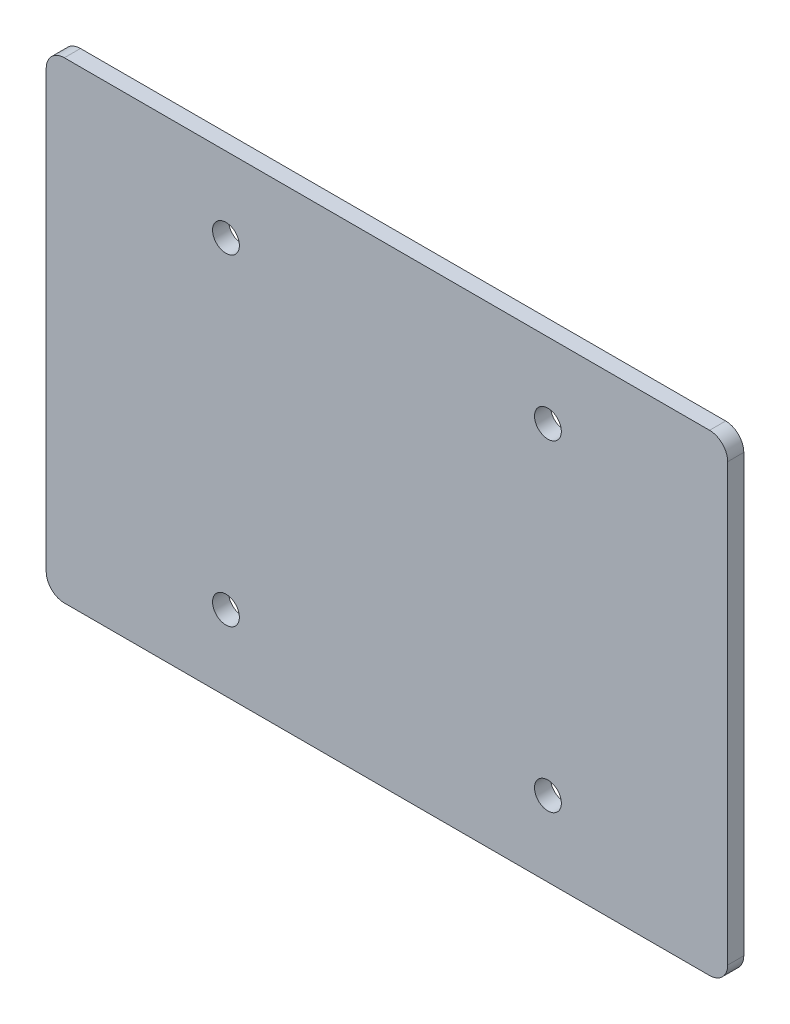
ISO-10303-21;
HEADER;
FILE_DESCRIPTION(('STEP AP214'),'2;1');
FILE_NAME('part.step','',(''),(''),'','','');
FILE_SCHEMA(('AUTOMOTIVE_DESIGN { 1 0 10303 214 1 1 1 1 }'));
ENDSEC;
DATA;
#1=APPLICATION_CONTEXT('core data for automotive mechanical design processes');
#2=APPLICATION_PROTOCOL_DEFINITION('international standard','automotive_design',2000,#1);
#3=PRODUCT_CONTEXT('',#1,'mechanical');
#4=PRODUCT('Part','Part','',(#3));
#5=PRODUCT_RELATED_PRODUCT_CATEGORY('part','',(#4));
#6=PRODUCT_DEFINITION_FORMATION('','',#4);
#7=PRODUCT_DEFINITION_CONTEXT('part definition',#1,'design');
#8=PRODUCT_DEFINITION('design','',#6,#7);
#9=PRODUCT_DEFINITION_SHAPE('','',#8);
#10=(LENGTH_UNIT() NAMED_UNIT(*) SI_UNIT(.MILLI.,.METRE.));
#11=(NAMED_UNIT(*) PLANE_ANGLE_UNIT() SI_UNIT($,.RADIAN.));
#12=(NAMED_UNIT(*) SI_UNIT($,.STERADIAN.) SOLID_ANGLE_UNIT());
#13=UNCERTAINTY_MEASURE_WITH_UNIT(LENGTH_MEASURE(1.E-05),#10,'distance_accuracy_value','');
#14=(GEOMETRIC_REPRESENTATION_CONTEXT(3) GLOBAL_UNCERTAINTY_ASSIGNED_CONTEXT((#13)) GLOBAL_UNIT_ASSIGNED_CONTEXT((#10,
#11,#12)) REPRESENTATION_CONTEXT('',''));
#15=CARTESIAN_POINT('',(0.,0.,0.));
#16=DIRECTION('',(0.,0.,1.));
#17=DIRECTION('',(1.,0.,0.));
#18=AXIS2_PLACEMENT_3D('',#15,#16,#17);
#19=CARTESIAN_POINT('',(63.5,-44.,3.));
#20=DIRECTION('',(-1.,0.,0.));
#21=DIRECTION('',(0.,0.,1.));
#22=AXIS2_PLACEMENT_3D('',#19,#20,#21);
#23=PLANE('',#22);
#24=DIRECTION('',(0.,1.,0.));
#25=VECTOR('',#24,1.);
#26=CARTESIAN_POINT('',(63.5,-44.,3.));
#27=LINE('',#26,#25);
#28=CARTESIAN_POINT('',(63.5,-40.62,3.));
#29=VERTEX_POINT('',#28);
#30=CARTESIAN_POINT('',(63.5,40.62,3.));
#31=VERTEX_POINT('',#30);
#32=EDGE_CURVE('E125',#29,#31,#27,.T.);
#33=ORIENTED_EDGE('',*,*,#32,.F.);
#34=DIRECTION('',(0.,0.,-1.));
#35=VECTOR('',#34,1.);
#36=CARTESIAN_POINT('',(63.5,-40.62,3.));
#37=LINE('',#36,#35);
#38=CARTESIAN_POINT('',(63.5,-40.62,0.));
#39=VERTEX_POINT('',#38);
#40=EDGE_CURVE('E151',#29,#39,#37,.T.);
#41=ORIENTED_EDGE('',*,*,#40,.T.);
#42=DIRECTION('',(0.,1.,0.));
#43=VECTOR('',#42,1.);
#44=CARTESIAN_POINT('',(63.5,-44.,0.));
#45=LINE('',#44,#43);
#46=CARTESIAN_POINT('',(63.5,40.62,0.));
#47=VERTEX_POINT('',#46);
#48=EDGE_CURVE('E157',#39,#47,#45,.T.);
#49=ORIENTED_EDGE('',*,*,#48,.T.);
#50=DIRECTION('',(0.,0.,-1.));
#51=VECTOR('',#50,1.);
#52=CARTESIAN_POINT('',(63.5,40.62,3.));
#53=LINE('',#52,#51);
#54=EDGE_CURVE('E149',#47,#31,#53,.F.);
#55=ORIENTED_EDGE('',*,*,#54,.T.);
#56=EDGE_LOOP('',(#33,#41,#49,#55));
#57=FACE_BOUND('',#56,.T.);
#58=ADVANCED_FACE('F33',(#57),#23,.F.);
#59=CARTESIAN_POINT('',(-63.5,44.,3.));
#60=DIRECTION('',(0.,-1.,0.));
#61=DIRECTION('',(0.,0.,-1.));
#62=AXIS2_PLACEMENT_3D('',#59,#60,#61);
#63=PLANE('',#62);
#64=DIRECTION('',(-1.,0.,0.));
#65=VECTOR('',#64,1.);
#66=CARTESIAN_POINT('',(-63.5,44.,3.));
#67=LINE('',#66,#65);
#68=CARTESIAN_POINT('',(60.12,44.,3.));
#69=VERTEX_POINT('',#68);
#70=CARTESIAN_POINT('',(-60.12,44.,3.));
#71=VERTEX_POINT('',#70);
#72=EDGE_CURVE('E128',#69,#71,#67,.T.);
#73=ORIENTED_EDGE('',*,*,#72,.F.);
#74=DIRECTION('',(0.,0.,-1.));
#75=VECTOR('',#74,1.);
#76=CARTESIAN_POINT('',(60.12,44.,3.));
#77=LINE('',#76,#75);
#78=CARTESIAN_POINT('',(60.12,44.,0.));
#79=VERTEX_POINT('',#78);
#80=EDGE_CURVE('E11',#69,#79,#77,.T.);
#81=ORIENTED_EDGE('',*,*,#80,.T.);
#82=DIRECTION('',(-1.,0.,0.));
#83=VECTOR('',#82,1.);
#84=CARTESIAN_POINT('',(-63.5,44.,0.));
#85=LINE('',#84,#83);
#86=CARTESIAN_POINT('',(-60.12,44.,0.));
#87=VERTEX_POINT('',#86);
#88=EDGE_CURVE('E130',#79,#87,#85,.T.);
#89=ORIENTED_EDGE('',*,*,#88,.T.);
#90=DIRECTION('',(0.,0.,-1.));
#91=VECTOR('',#90,1.);
#92=CARTESIAN_POINT('',(-60.12,44.,3.));
#93=LINE('',#92,#91);
#94=EDGE_CURVE('E41',#87,#71,#93,.F.);
#95=ORIENTED_EDGE('',*,*,#94,.T.);
#96=EDGE_LOOP('',(#73,#81,#89,#95));
#97=FACE_BOUND('',#96,.T.);
#98=ADVANCED_FACE('F223',(#97),#63,.F.);
#99=CARTESIAN_POINT('',(-63.5,-44.,3.));
#100=DIRECTION('',(1.,0.,0.));
#101=DIRECTION('',(0.,0.,-1.));
#102=AXIS2_PLACEMENT_3D('',#99,#100,#101);
#103=PLANE('',#102);
#104=DIRECTION('',(0.,-1.,0.));
#105=VECTOR('',#104,1.);
#106=CARTESIAN_POINT('',(-63.5,-44.,0.));
#107=LINE('',#106,#105);
#108=CARTESIAN_POINT('',(-63.5,40.62,0.));
#109=VERTEX_POINT('',#108);
#110=CARTESIAN_POINT('',(-63.5,-40.62,0.));
#111=VERTEX_POINT('',#110);
#112=EDGE_CURVE('E126',#109,#111,#107,.T.);
#113=ORIENTED_EDGE('',*,*,#112,.T.);
#114=DIRECTION('',(0.,0.,-1.));
#115=VECTOR('',#114,1.);
#116=CARTESIAN_POINT('',(-63.5,-40.62,3.));
#117=LINE('',#116,#115);
#118=CARTESIAN_POINT('',(-63.5,-40.62,3.));
#119=VERTEX_POINT('',#118);
#120=EDGE_CURVE('E104',#111,#119,#117,.F.);
#121=ORIENTED_EDGE('',*,*,#120,.T.);
#122=DIRECTION('',(0.,-1.,0.));
#123=VECTOR('',#122,1.);
#124=CARTESIAN_POINT('',(-63.5,-44.,3.));
#125=LINE('',#124,#123);
#126=CARTESIAN_POINT('',(-63.5,40.62,3.));
#127=VERTEX_POINT('',#126);
#128=EDGE_CURVE('E169',#127,#119,#125,.T.);
#129=ORIENTED_EDGE('',*,*,#128,.F.);
#130=DIRECTION('',(0.,0.,-1.));
#131=VECTOR('',#130,1.);
#132=CARTESIAN_POINT('',(-63.5,40.62,3.));
#133=LINE('',#132,#131);
#134=EDGE_CURVE('E109',#127,#109,#133,.T.);
#135=ORIENTED_EDGE('',*,*,#134,.T.);
#136=EDGE_LOOP('',(#113,#121,#129,#135));
#137=FACE_BOUND('',#136,.T.);
#138=ADVANCED_FACE('F228',(#137),#103,.F.);
#139=CARTESIAN_POINT('',(-63.5,-44.,3.));
#140=DIRECTION('',(0.,1.,0.));
#141=DIRECTION('',(0.,0.,1.));
#142=AXIS2_PLACEMENT_3D('',#139,#140,#141);
#143=PLANE('',#142);
#144=DIRECTION('',(1.,0.,0.));
#145=VECTOR('',#144,1.);
#146=CARTESIAN_POINT('',(-63.5,-44.,3.));
#147=LINE('',#146,#145);
#148=CARTESIAN_POINT('',(-60.12,-44.,3.));
#149=VERTEX_POINT('',#148);
#150=CARTESIAN_POINT('',(60.12,-44.,3.));
#151=VERTEX_POINT('',#150);
#152=EDGE_CURVE('E119',#149,#151,#147,.T.);
#153=ORIENTED_EDGE('',*,*,#152,.F.);
#154=DIRECTION('',(0.,0.,-1.));
#155=VECTOR('',#154,1.);
#156=CARTESIAN_POINT('',(-60.12,-44.,3.));
#157=LINE('',#156,#155);
#158=CARTESIAN_POINT('',(-60.12,-44.,0.));
#159=VERTEX_POINT('',#158);
#160=EDGE_CURVE('E103',#149,#159,#157,.T.);
#161=ORIENTED_EDGE('',*,*,#160,.T.);
#162=DIRECTION('',(1.,0.,0.));
#163=VECTOR('',#162,1.);
#164=CARTESIAN_POINT('',(-63.5,-44.,0.));
#165=LINE('',#164,#163);
#166=CARTESIAN_POINT('',(60.12,-44.,0.));
#167=VERTEX_POINT('',#166);
#168=EDGE_CURVE('E116',#159,#167,#165,.T.);
#169=ORIENTED_EDGE('',*,*,#168,.T.);
#170=DIRECTION('',(0.,0.,-1.));
#171=VECTOR('',#170,1.);
#172=CARTESIAN_POINT('',(60.12,-44.,3.));
#173=LINE('',#172,#171);
#174=EDGE_CURVE('E121',#167,#151,#173,.F.);
#175=ORIENTED_EDGE('',*,*,#174,.T.);
#176=EDGE_LOOP('',(#153,#161,#169,#175));
#177=FACE_BOUND('',#176,.T.);
#178=ADVANCED_FACE('F115',(#177),#143,.F.);
#179=CARTESIAN_POINT('',(0.,0.,3.));
#180=DIRECTION('',(0.,0.,-1.));
#181=DIRECTION('',(-1.,0.,0.));
#182=AXIS2_PLACEMENT_3D('',#179,#180,#181);
#183=PLANE('',#182);
#184=CARTESIAN_POINT('',(-30.0000000000067,-30.000000000004,3.));
#185=DIRECTION('',(0.,0.,-1.));
#186=DIRECTION('',(-1.,0.,0.));
#187=AXIS2_PLACEMENT_3D('',#184,#185,#186);
#188=CIRCLE('',#187,2.49999999999989);
#189=CARTESIAN_POINT('',(-32.5000000000066,-30.000000000004,3.));
#190=VERTEX_POINT('',#189);
#191=EDGE_CURVE('E179',#190,#190,#188,.T.);
#192=ORIENTED_EDGE('',*,*,#191,.T.);
#193=EDGE_LOOP('',(#192));
#194=FACE_BOUND('',#193,.T.);
#195=CARTESIAN_POINT('',(-30.0000000000067,29.9999999999963,3.));
#196=DIRECTION('',(0.,0.,-1.));
#197=DIRECTION('',(-1.,0.,0.));
#198=AXIS2_PLACEMENT_3D('',#195,#196,#197);
#199=CIRCLE('',#198,2.5);
#200=CARTESIAN_POINT('',(-32.5000000000067,29.9999999999963,3.));
#201=VERTEX_POINT('',#200);
#202=EDGE_CURVE('E185',#201,#201,#199,.T.);
#203=ORIENTED_EDGE('',*,*,#202,.T.);
#204=EDGE_LOOP('',(#203));
#205=FACE_BOUND('',#204,.T.);
#206=CARTESIAN_POINT('',(29.9999999999934,29.9999999999964,3.));
#207=DIRECTION('',(0.,0.,-1.));
#208=DIRECTION('',(-1.,0.,0.));
#209=AXIS2_PLACEMENT_3D('',#206,#207,#208);
#210=CIRCLE('',#209,2.4999999999997);
#211=CARTESIAN_POINT('',(27.4999999999937,29.9999999999964,3.));
#212=VERTEX_POINT('',#211);
#213=EDGE_CURVE('E174',#212,#212,#210,.T.);
#214=ORIENTED_EDGE('',*,*,#213,.T.);
#215=EDGE_LOOP('',(#214));
#216=FACE_BOUND('',#215,.T.);
#217=CARTESIAN_POINT('',(29.9999999999933,-30.0000000000038,3.));
#218=DIRECTION('',(0.,0.,-1.));
#219=DIRECTION('',(-1.,0.,0.));
#220=AXIS2_PLACEMENT_3D('',#217,#218,#219);
#221=CIRCLE('',#220,2.49999999999997);
#222=CARTESIAN_POINT('',(27.4999999999933,-30.0000000000038,3.));
#223=VERTEX_POINT('',#222);
#224=EDGE_CURVE('E162',#223,#223,#221,.T.);
#225=ORIENTED_EDGE('',*,*,#224,.T.);
#226=EDGE_LOOP('',(#225));
#227=FACE_BOUND('',#226,.T.);
#228=ORIENTED_EDGE('',*,*,#128,.T.);
#229=CARTESIAN_POINT('',(-60.12,-40.62,3.));
#230=DIRECTION('',(0.,0.,-1.));
#231=DIRECTION('',(-1.,0.,0.));
#232=AXIS2_PLACEMENT_3D('',#229,#230,#231);
#233=CIRCLE('',#232,3.38);
#234=EDGE_CURVE('E147',#119,#149,#233,.F.);
#235=ORIENTED_EDGE('',*,*,#234,.T.);
#236=ORIENTED_EDGE('',*,*,#152,.T.);
#237=CARTESIAN_POINT('',(60.12,-40.62,3.));
#238=DIRECTION('',(0.,0.,-1.));
#239=DIRECTION('',(-1.,0.,0.));
#240=AXIS2_PLACEMENT_3D('',#237,#238,#239);
#241=CIRCLE('',#240,3.38);
#242=EDGE_CURVE('E145',#151,#29,#241,.F.);
#243=ORIENTED_EDGE('',*,*,#242,.T.);
#244=ORIENTED_EDGE('',*,*,#32,.T.);
#245=CARTESIAN_POINT('',(60.12,40.62,3.));
#246=DIRECTION('',(0.,0.,-1.));
#247=DIRECTION('',(-1.,0.,0.));
#248=AXIS2_PLACEMENT_3D('',#245,#246,#247);
#249=CIRCLE('',#248,3.38);
#250=EDGE_CURVE('E54',#31,#69,#249,.F.);
#251=ORIENTED_EDGE('',*,*,#250,.T.);
#252=ORIENTED_EDGE('',*,*,#72,.T.);
#253=CARTESIAN_POINT('',(-60.12,40.62,3.));
#254=DIRECTION('',(0.,0.,-1.));
#255=DIRECTION('',(-1.,0.,0.));
#256=AXIS2_PLACEMENT_3D('',#253,#254,#255);
#257=CIRCLE('',#256,3.38);
#258=EDGE_CURVE('E142',#71,#127,#257,.F.);
#259=ORIENTED_EDGE('',*,*,#258,.T.);
#260=EDGE_LOOP('',(#228,#235,#236,#243,#244,#251,#252,#259));
#261=FACE_BOUND('',#260,.T.);
#262=ADVANCED_FACE('F194',(#194,#205,#216,#227,#261),#183,.F.);
#263=CARTESIAN_POINT('',(0.,0.,0.));
#264=DIRECTION('',(0.,0.,-1.));
#265=DIRECTION('',(-1.,0.,0.));
#266=AXIS2_PLACEMENT_3D('',#263,#264,#265);
#267=PLANE('',#266);
#268=CARTESIAN_POINT('',(-30.0000000000067,-30.000000000004,0.));
#269=DIRECTION('',(0.,0.,-1.));
#270=DIRECTION('',(-1.,0.,0.));
#271=AXIS2_PLACEMENT_3D('',#268,#269,#270);
#272=CIRCLE('',#271,2.49999999999989);
#273=CARTESIAN_POINT('',(-32.5000000000066,-30.000000000004,0.));
#274=VERTEX_POINT('',#273);
#275=EDGE_CURVE('E176',#274,#274,#272,.T.);
#276=ORIENTED_EDGE('',*,*,#275,.F.);
#277=EDGE_LOOP('',(#276));
#278=FACE_BOUND('',#277,.T.);
#279=CARTESIAN_POINT('',(-30.0000000000067,29.9999999999963,0.));
#280=DIRECTION('',(0.,0.,-1.));
#281=DIRECTION('',(-1.,0.,0.));
#282=AXIS2_PLACEMENT_3D('',#279,#280,#281);
#283=CIRCLE('',#282,2.5);
#284=CARTESIAN_POINT('',(-32.5000000000067,29.9999999999963,0.));
#285=VERTEX_POINT('',#284);
#286=EDGE_CURVE('E182',#285,#285,#283,.T.);
#287=ORIENTED_EDGE('',*,*,#286,.F.);
#288=EDGE_LOOP('',(#287));
#289=FACE_BOUND('',#288,.T.);
#290=CARTESIAN_POINT('',(29.9999999999934,29.9999999999964,0.));
#291=DIRECTION('',(0.,0.,-1.));
#292=DIRECTION('',(-1.,0.,0.));
#293=AXIS2_PLACEMENT_3D('',#290,#291,#292);
#294=CIRCLE('',#293,2.4999999999997);
#295=CARTESIAN_POINT('',(27.4999999999937,29.9999999999964,0.));
#296=VERTEX_POINT('',#295);
#297=EDGE_CURVE('E188',#296,#296,#294,.T.);
#298=ORIENTED_EDGE('',*,*,#297,.F.);
#299=EDGE_LOOP('',(#298));
#300=FACE_BOUND('',#299,.T.);
#301=CARTESIAN_POINT('',(29.9999999999933,-30.0000000000038,0.));
#302=DIRECTION('',(0.,0.,-1.));
#303=DIRECTION('',(-1.,0.,0.));
#304=AXIS2_PLACEMENT_3D('',#301,#302,#303);
#305=CIRCLE('',#304,2.49999999999997);
#306=CARTESIAN_POINT('',(27.4999999999933,-30.0000000000038,0.));
#307=VERTEX_POINT('',#306);
#308=EDGE_CURVE('E165',#307,#307,#305,.T.);
#309=ORIENTED_EDGE('',*,*,#308,.F.);
#310=EDGE_LOOP('',(#309));
#311=FACE_BOUND('',#310,.T.);
#312=ORIENTED_EDGE('',*,*,#168,.F.);
#313=CARTESIAN_POINT('',(-60.12,-40.62,0.));
#314=DIRECTION('',(0.,0.,-1.));
#315=DIRECTION('',(-1.,0.,0.));
#316=AXIS2_PLACEMENT_3D('',#313,#314,#315);
#317=CIRCLE('',#316,3.38);
#318=EDGE_CURVE('E99',#159,#111,#317,.T.);
#319=ORIENTED_EDGE('',*,*,#318,.T.);
#320=ORIENTED_EDGE('',*,*,#112,.F.);
#321=CARTESIAN_POINT('',(-60.12,40.62,0.));
#322=DIRECTION('',(0.,0.,-1.));
#323=DIRECTION('',(-1.,0.,0.));
#324=AXIS2_PLACEMENT_3D('',#321,#322,#323);
#325=CIRCLE('',#324,3.38);
#326=EDGE_CURVE('E120',#109,#87,#325,.T.);
#327=ORIENTED_EDGE('',*,*,#326,.T.);
#328=ORIENTED_EDGE('',*,*,#88,.F.);
#329=CARTESIAN_POINT('',(60.12,40.62,0.));
#330=DIRECTION('',(0.,0.,-1.));
#331=DIRECTION('',(-1.,0.,0.));
#332=AXIS2_PLACEMENT_3D('',#329,#330,#331);
#333=CIRCLE('',#332,3.38);
#334=EDGE_CURVE('E136',#79,#47,#333,.T.);
#335=ORIENTED_EDGE('',*,*,#334,.T.);
#336=ORIENTED_EDGE('',*,*,#48,.F.);
#337=CARTESIAN_POINT('',(60.12,-40.62,0.));
#338=DIRECTION('',(0.,0.,-1.));
#339=DIRECTION('',(-1.,0.,0.));
#340=AXIS2_PLACEMENT_3D('',#337,#338,#339);
#341=CIRCLE('',#340,3.38);
#342=EDGE_CURVE('E110',#39,#167,#341,.T.);
#343=ORIENTED_EDGE('',*,*,#342,.T.);
#344=EDGE_LOOP('',(#312,#319,#320,#327,#328,#335,#336,#343));
#345=FACE_BOUND('',#344,.T.);
#346=ADVANCED_FACE('F123',(#278,#289,#300,#311,#345),#267,.T.);
#347=CARTESIAN_POINT('',(-60.12,-40.62,3.));
#348=DIRECTION('',(0.,0.,-1.));
#349=DIRECTION('',(-1.,0.,0.));
#350=AXIS2_PLACEMENT_3D('',#347,#348,#349);
#351=CYLINDRICAL_SURFACE('',#350,3.38);
#352=ORIENTED_EDGE('',*,*,#234,.F.);
#353=ORIENTED_EDGE('',*,*,#120,.F.);
#354=ORIENTED_EDGE('',*,*,#318,.F.);
#355=ORIENTED_EDGE('',*,*,#160,.F.);
#356=EDGE_LOOP('',(#352,#353,#354,#355));
#357=FACE_BOUND('',#356,.T.);
#358=ADVANCED_FACE('F102',(#357),#351,.T.);
#359=CARTESIAN_POINT('',(60.12,-40.62,3.));
#360=DIRECTION('',(0.,0.,-1.));
#361=DIRECTION('',(-1.,0.,0.));
#362=AXIS2_PLACEMENT_3D('',#359,#360,#361);
#363=CYLINDRICAL_SURFACE('',#362,3.38);
#364=ORIENTED_EDGE('',*,*,#242,.F.);
#365=ORIENTED_EDGE('',*,*,#174,.F.);
#366=ORIENTED_EDGE('',*,*,#342,.F.);
#367=ORIENTED_EDGE('',*,*,#40,.F.);
#368=EDGE_LOOP('',(#364,#365,#366,#367));
#369=FACE_BOUND('',#368,.T.);
#370=ADVANCED_FACE('F234',(#369),#363,.T.);
#371=CARTESIAN_POINT('',(60.12,40.62,3.));
#372=DIRECTION('',(0.,0.,-1.));
#373=DIRECTION('',(-1.,0.,0.));
#374=AXIS2_PLACEMENT_3D('',#371,#372,#373);
#375=CYLINDRICAL_SURFACE('',#374,3.38);
#376=ORIENTED_EDGE('',*,*,#250,.F.);
#377=ORIENTED_EDGE('',*,*,#54,.F.);
#378=ORIENTED_EDGE('',*,*,#334,.F.);
#379=ORIENTED_EDGE('',*,*,#80,.F.);
#380=EDGE_LOOP('',(#376,#377,#378,#379));
#381=FACE_BOUND('',#380,.T.);
#382=ADVANCED_FACE('F217',(#381),#375,.T.);
#383=CARTESIAN_POINT('',(-60.12,40.62,3.));
#384=DIRECTION('',(0.,0.,-1.));
#385=DIRECTION('',(-1.,0.,0.));
#386=AXIS2_PLACEMENT_3D('',#383,#384,#385);
#387=CYLINDRICAL_SURFACE('',#386,3.38);
#388=ORIENTED_EDGE('',*,*,#258,.F.);
#389=ORIENTED_EDGE('',*,*,#94,.F.);
#390=ORIENTED_EDGE('',*,*,#326,.F.);
#391=ORIENTED_EDGE('',*,*,#134,.F.);
#392=EDGE_LOOP('',(#388,#389,#390,#391));
#393=FACE_BOUND('',#392,.T.);
#394=ADVANCED_FACE('F35',(#393),#387,.T.);
#395=CARTESIAN_POINT('',(29.9999999999933,-30.0000000000038,3.));
#396=DIRECTION('',(0.,0.,-1.));
#397=DIRECTION('',(-1.,0.,0.));
#398=AXIS2_PLACEMENT_3D('',#395,#396,#397);
#399=CYLINDRICAL_SURFACE('',#398,2.49999999999997);
#400=ORIENTED_EDGE('',*,*,#224,.F.);
#401=EDGE_LOOP('',(#400));
#402=FACE_BOUND('',#401,.T.);
#403=ORIENTED_EDGE('',*,*,#308,.T.);
#404=EDGE_LOOP('',(#403));
#405=FACE_BOUND('',#404,.T.);
#406=ADVANCED_FACE('F201',(#402,#405),#399,.F.);
#407=CARTESIAN_POINT('',(29.9999999999934,29.9999999999964,3.));
#408=DIRECTION('',(0.,0.,-1.));
#409=DIRECTION('',(-1.,0.,0.));
#410=AXIS2_PLACEMENT_3D('',#407,#408,#409);
#411=CYLINDRICAL_SURFACE('',#410,2.4999999999997);
#412=ORIENTED_EDGE('',*,*,#213,.F.);
#413=EDGE_LOOP('',(#412));
#414=FACE_BOUND('',#413,.T.);
#415=ORIENTED_EDGE('',*,*,#297,.T.);
#416=EDGE_LOOP('',(#415));
#417=FACE_BOUND('',#416,.T.);
#418=ADVANCED_FACE('F197',(#414,#417),#411,.F.);
#419=CARTESIAN_POINT('',(-30.0000000000067,29.9999999999963,3.));
#420=DIRECTION('',(0.,0.,-1.));
#421=DIRECTION('',(-1.,0.,0.));
#422=AXIS2_PLACEMENT_3D('',#419,#420,#421);
#423=CYLINDRICAL_SURFACE('',#422,2.5);
#424=ORIENTED_EDGE('',*,*,#202,.F.);
#425=EDGE_LOOP('',(#424));
#426=FACE_BOUND('',#425,.T.);
#427=ORIENTED_EDGE('',*,*,#286,.T.);
#428=EDGE_LOOP('',(#427));
#429=FACE_BOUND('',#428,.T.);
#430=ADVANCED_FACE('F200',(#426,#429),#423,.F.);
#431=CARTESIAN_POINT('',(-30.0000000000067,-30.000000000004,3.));
#432=DIRECTION('',(0.,0.,-1.));
#433=DIRECTION('',(-1.,0.,0.));
#434=AXIS2_PLACEMENT_3D('',#431,#432,#433);
#435=CYLINDRICAL_SURFACE('',#434,2.49999999999989);
#436=ORIENTED_EDGE('',*,*,#191,.F.);
#437=EDGE_LOOP('',(#436));
#438=FACE_BOUND('',#437,.T.);
#439=ORIENTED_EDGE('',*,*,#275,.T.);
#440=EDGE_LOOP('',(#439));
#441=FACE_BOUND('',#440,.T.);
#442=ADVANCED_FACE('F312',(#438,#441),#435,.F.);
#443=CLOSED_SHELL('',(#58,#98,#138,#178,#262,#346,#358,#370,#382,#394,#406,#418,#430,#442));
#444=MANIFOLD_SOLID_BREP('B2',#443);
#445=ADVANCED_BREP_SHAPE_REPRESENTATION('',(#18,#444),#14);
#446=SHAPE_DEFINITION_REPRESENTATION(#9,#445);
ENDSEC;
END-ISO-10303-21;
